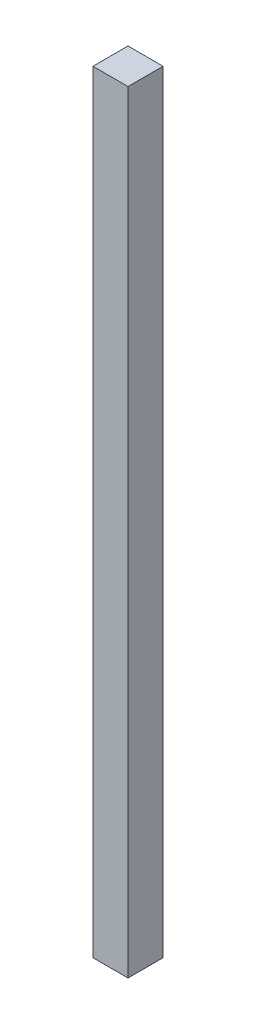
ISO-10303-21;
HEADER;
FILE_DESCRIPTION(('STEP AP214'),'2;1');
FILE_NAME('part.step','',(''),(''),'','','');
FILE_SCHEMA(('AUTOMOTIVE_DESIGN { 1 0 10303 214 1 1 1 1 }'));
ENDSEC;
DATA;
#1=APPLICATION_CONTEXT('core data for automotive mechanical design processes');
#2=APPLICATION_PROTOCOL_DEFINITION('international standard','automotive_design',2000,#1);
#3=PRODUCT_CONTEXT('',#1,'mechanical');
#4=PRODUCT('Part','Part','',(#3));
#5=PRODUCT_RELATED_PRODUCT_CATEGORY('part','',(#4));
#6=PRODUCT_DEFINITION_FORMATION('','',#4);
#7=PRODUCT_DEFINITION_CONTEXT('part definition',#1,'design');
#8=PRODUCT_DEFINITION('design','',#6,#7);
#9=PRODUCT_DEFINITION_SHAPE('','',#8);
#10=(LENGTH_UNIT() NAMED_UNIT(*) SI_UNIT(.MILLI.,.METRE.));
#11=(NAMED_UNIT(*) PLANE_ANGLE_UNIT() SI_UNIT($,.RADIAN.));
#12=(NAMED_UNIT(*) SI_UNIT($,.STERADIAN.) SOLID_ANGLE_UNIT());
#13=UNCERTAINTY_MEASURE_WITH_UNIT(LENGTH_MEASURE(1.E-05),#10,'distance_accuracy_value','');
#14=(GEOMETRIC_REPRESENTATION_CONTEXT(3) GLOBAL_UNCERTAINTY_ASSIGNED_CONTEXT((#13)) GLOBAL_UNIT_ASSIGNED_CONTEXT((#10,
#11,#12)) REPRESENTATION_CONTEXT('',''));
#15=CARTESIAN_POINT('',(0.,0.,0.));
#16=DIRECTION('',(0.,0.,1.));
#17=DIRECTION('',(1.,0.,0.));
#18=AXIS2_PLACEMENT_3D('',#15,#16,#17);
#19=CARTESIAN_POINT('',(-50.,2200.,50.));
#20=DIRECTION('',(1.,0.,0.));
#21=DIRECTION('',(0.,0.,-1.));
#22=AXIS2_PLACEMENT_3D('',#19,#20,#21);
#23=PLANE('',#22);
#24=DIRECTION('',(0.,0.,1.));
#25=VECTOR('',#24,1.);
#26=CARTESIAN_POINT('',(-50.,0.,50.));
#27=LINE('',#26,#25);
#28=CARTESIAN_POINT('',(-50.,0.,-50.));
#29=VERTEX_POINT('',#28);
#30=CARTESIAN_POINT('',(-50.,0.,50.));
#31=VERTEX_POINT('',#30);
#32=EDGE_CURVE('E100',#29,#31,#27,.T.);
#33=ORIENTED_EDGE('',*,*,#32,.T.);
#34=DIRECTION('',(0.,-1.,0.));
#35=VECTOR('',#34,1.);
#36=CARTESIAN_POINT('',(-50.,2200.,50.));
#37=LINE('',#36,#35);
#38=CARTESIAN_POINT('',(-50.,2200.,50.));
#39=VERTEX_POINT('',#38);
#40=EDGE_CURVE('E11',#39,#31,#37,.T.);
#41=ORIENTED_EDGE('',*,*,#40,.F.);
#42=DIRECTION('',(0.,0.,1.));
#43=VECTOR('',#42,1.);
#44=CARTESIAN_POINT('',(-50.,2200.,50.));
#45=LINE('',#44,#43);
#46=CARTESIAN_POINT('',(-50.,2200.,-50.));
#47=VERTEX_POINT('',#46);
#48=EDGE_CURVE('E88',#47,#39,#45,.T.);
#49=ORIENTED_EDGE('',*,*,#48,.F.);
#50=DIRECTION('',(0.,-1.,0.));
#51=VECTOR('',#50,1.);
#52=CARTESIAN_POINT('',(-50.,2200.,-50.));
#53=LINE('',#52,#51);
#54=EDGE_CURVE('E96',#47,#29,#53,.T.);
#55=ORIENTED_EDGE('',*,*,#54,.T.);
#56=EDGE_LOOP('',(#33,#41,#49,#55));
#57=FACE_BOUND('',#56,.T.);
#58=ADVANCED_FACE('F37',(#57),#23,.F.);
#59=CARTESIAN_POINT('',(50.,2200.,50.));
#60=DIRECTION('',(0.,0.,-1.));
#61=DIRECTION('',(-1.,0.,0.));
#62=AXIS2_PLACEMENT_3D('',#59,#60,#61);
#63=PLANE('',#62);
#64=DIRECTION('',(1.,0.,0.));
#65=VECTOR('',#64,1.);
#66=CARTESIAN_POINT('',(50.,0.,50.));
#67=LINE('',#66,#65);
#68=CARTESIAN_POINT('',(50.,0.,50.));
#69=VERTEX_POINT('',#68);
#70=EDGE_CURVE('E92',#31,#69,#67,.T.);
#71=ORIENTED_EDGE('',*,*,#70,.T.);
#72=DIRECTION('',(0.,-1.,0.));
#73=VECTOR('',#72,1.);
#74=CARTESIAN_POINT('',(50.,2200.,50.));
#75=LINE('',#74,#73);
#76=CARTESIAN_POINT('',(50.,2200.,50.));
#77=VERTEX_POINT('',#76);
#78=EDGE_CURVE('E45',#77,#69,#75,.T.);
#79=ORIENTED_EDGE('',*,*,#78,.F.);
#80=DIRECTION('',(1.,0.,0.));
#81=VECTOR('',#80,1.);
#82=CARTESIAN_POINT('',(50.,2200.,50.));
#83=LINE('',#82,#81);
#84=EDGE_CURVE('E83',#39,#77,#83,.T.);
#85=ORIENTED_EDGE('',*,*,#84,.F.);
#86=ORIENTED_EDGE('',*,*,#40,.T.);
#87=EDGE_LOOP('',(#71,#79,#85,#86));
#88=FACE_BOUND('',#87,.T.);
#89=ADVANCED_FACE('F91',(#88),#63,.F.);
#90=CARTESIAN_POINT('',(50.,2200.,50.));
#91=DIRECTION('',(-1.,0.,0.));
#92=DIRECTION('',(0.,0.,1.));
#93=AXIS2_PLACEMENT_3D('',#90,#91,#92);
#94=PLANE('',#93);
#95=DIRECTION('',(0.,0.,-1.));
#96=VECTOR('',#95,1.);
#97=CARTESIAN_POINT('',(50.,0.,50.));
#98=LINE('',#97,#96);
#99=CARTESIAN_POINT('',(50.,0.,-50.));
#100=VERTEX_POINT('',#99);
#101=EDGE_CURVE('E70',#69,#100,#98,.T.);
#102=ORIENTED_EDGE('',*,*,#101,.T.);
#103=DIRECTION('',(0.,-1.,0.));
#104=VECTOR('',#103,1.);
#105=CARTESIAN_POINT('',(50.,2200.,-50.));
#106=LINE('',#105,#104);
#107=CARTESIAN_POINT('',(50.,2200.,-50.));
#108=VERTEX_POINT('',#107);
#109=EDGE_CURVE('E93',#108,#100,#106,.T.);
#110=ORIENTED_EDGE('',*,*,#109,.F.);
#111=DIRECTION('',(0.,0.,-1.));
#112=VECTOR('',#111,1.);
#113=CARTESIAN_POINT('',(50.,2200.,50.));
#114=LINE('',#113,#112);
#115=EDGE_CURVE('E86',#77,#108,#114,.T.);
#116=ORIENTED_EDGE('',*,*,#115,.F.);
#117=ORIENTED_EDGE('',*,*,#78,.T.);
#118=EDGE_LOOP('',(#102,#110,#116,#117));
#119=FACE_BOUND('',#118,.T.);
#120=ADVANCED_FACE('F94',(#119),#94,.F.);
#121=CARTESIAN_POINT('',(50.,2200.,-50.));
#122=DIRECTION('',(0.,0.,1.));
#123=DIRECTION('',(1.,0.,0.));
#124=AXIS2_PLACEMENT_3D('',#121,#122,#123);
#125=PLANE('',#124);
#126=DIRECTION('',(-1.,0.,0.));
#127=VECTOR('',#126,1.);
#128=CARTESIAN_POINT('',(50.,0.,-50.));
#129=LINE('',#128,#127);
#130=EDGE_CURVE('E76',#100,#29,#129,.T.);
#131=ORIENTED_EDGE('',*,*,#130,.T.);
#132=ORIENTED_EDGE('',*,*,#54,.F.);
#133=DIRECTION('',(-1.,0.,0.));
#134=VECTOR('',#133,1.);
#135=CARTESIAN_POINT('',(50.,2200.,-50.));
#136=LINE('',#135,#134);
#137=EDGE_CURVE('E53',#108,#47,#136,.T.);
#138=ORIENTED_EDGE('',*,*,#137,.F.);
#139=ORIENTED_EDGE('',*,*,#109,.T.);
#140=EDGE_LOOP('',(#131,#132,#138,#139));
#141=FACE_BOUND('',#140,.T.);
#142=ADVANCED_FACE('F107',(#141),#125,.F.);
#143=CARTESIAN_POINT('',(0.,2200.,0.));
#144=DIRECTION('',(0.,1.,0.));
#145=DIRECTION('',(0.,0.,1.));
#146=AXIS2_PLACEMENT_3D('',#143,#144,#145);
#147=PLANE('',#146);
#148=ORIENTED_EDGE('',*,*,#48,.T.);
#149=ORIENTED_EDGE('',*,*,#84,.T.);
#150=ORIENTED_EDGE('',*,*,#115,.T.);
#151=ORIENTED_EDGE('',*,*,#137,.T.);
#152=EDGE_LOOP('',(#148,#149,#150,#151));
#153=FACE_BOUND('',#152,.T.);
#154=ADVANCED_FACE('F84',(#153),#147,.T.);
#155=CARTESIAN_POINT('',(0.,0.,0.));
#156=DIRECTION('',(0.,1.,0.));
#157=DIRECTION('',(0.,0.,1.));
#158=AXIS2_PLACEMENT_3D('',#155,#156,#157);
#159=PLANE('',#158);
#160=ORIENTED_EDGE('',*,*,#32,.F.);
#161=ORIENTED_EDGE('',*,*,#130,.F.);
#162=ORIENTED_EDGE('',*,*,#101,.F.);
#163=ORIENTED_EDGE('',*,*,#70,.F.);
#164=EDGE_LOOP('',(#160,#161,#162,#163));
#165=FACE_BOUND('',#164,.T.);
#166=ADVANCED_FACE('F110',(#165),#159,.F.);
#167=CLOSED_SHELL('',(#58,#89,#120,#142,#154,#166));
#168=MANIFOLD_SOLID_BREP('B2',#167);
#169=ADVANCED_BREP_SHAPE_REPRESENTATION('',(#18,#168),#14);
#170=SHAPE_DEFINITION_REPRESENTATION(#9,#169);
ENDSEC;
END-ISO-10303-21;
